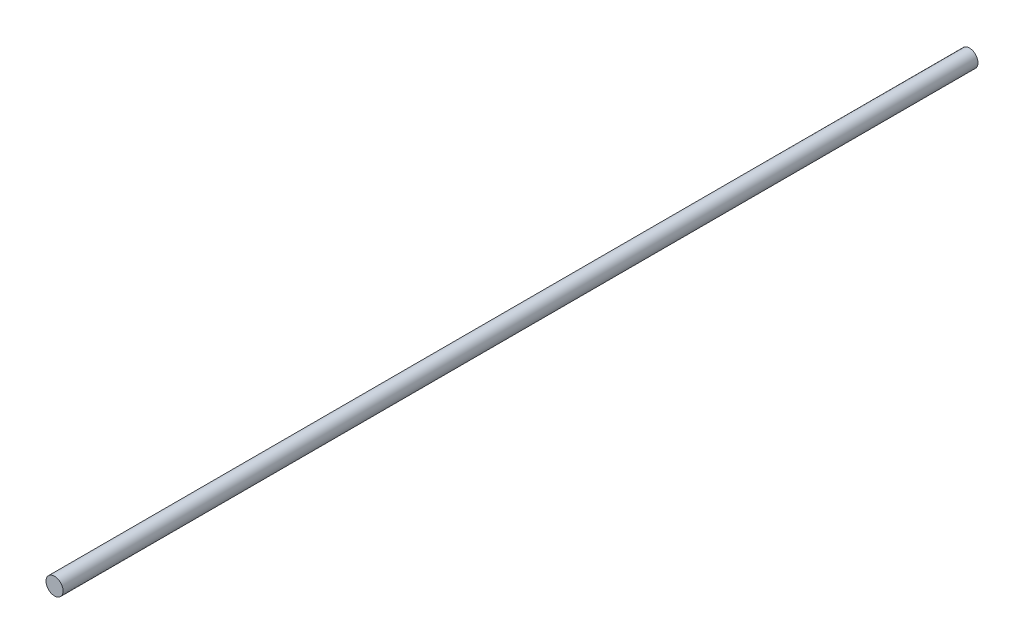
ISO-10303-21;
HEADER;
FILE_DESCRIPTION(('STEP AP214'),'2;1');
FILE_NAME('part.step','',(''),(''),'','','');
FILE_SCHEMA(('AUTOMOTIVE_DESIGN { 1 0 10303 214 1 1 1 1 }'));
ENDSEC;
DATA;
#1=APPLICATION_CONTEXT('core data for automotive mechanical design processes');
#2=APPLICATION_PROTOCOL_DEFINITION('international standard','automotive_design',2000,#1);
#3=PRODUCT_CONTEXT('',#1,'mechanical');
#4=PRODUCT('Part','Part','',(#3));
#5=PRODUCT_RELATED_PRODUCT_CATEGORY('part','',(#4));
#6=PRODUCT_DEFINITION_FORMATION('','',#4);
#7=PRODUCT_DEFINITION_CONTEXT('part definition',#1,'design');
#8=PRODUCT_DEFINITION('design','',#6,#7);
#9=PRODUCT_DEFINITION_SHAPE('','',#8);
#10=(LENGTH_UNIT() NAMED_UNIT(*) SI_UNIT(.MILLI.,.METRE.));
#11=(NAMED_UNIT(*) PLANE_ANGLE_UNIT() SI_UNIT($,.RADIAN.));
#12=(NAMED_UNIT(*) SI_UNIT($,.STERADIAN.) SOLID_ANGLE_UNIT());
#13=UNCERTAINTY_MEASURE_WITH_UNIT(LENGTH_MEASURE(1.E-05),#10,'distance_accuracy_value','');
#14=(GEOMETRIC_REPRESENTATION_CONTEXT(3) GLOBAL_UNCERTAINTY_ASSIGNED_CONTEXT((#13)) GLOBAL_UNIT_ASSIGNED_CONTEXT((#10,
#11,#12)) REPRESENTATION_CONTEXT('',''));
#15=CARTESIAN_POINT('',(0.,0.,0.));
#16=DIRECTION('',(0.,0.,1.));
#17=DIRECTION('',(1.,0.,0.));
#18=AXIS2_PLACEMENT_3D('',#15,#16,#17);
#19=CARTESIAN_POINT('',(0.,0.,428.));
#20=DIRECTION('',(0.,0.,-1.));
#21=DIRECTION('',(-1.,0.,0.));
#22=AXIS2_PLACEMENT_3D('',#19,#20,#21);
#23=CYLINDRICAL_SURFACE('',#22,4.);
#24=CARTESIAN_POINT('',(0.,0.,428.));
#25=DIRECTION('',(0.,0.,1.));
#26=DIRECTION('',(1.,0.,0.));
#27=AXIS2_PLACEMENT_3D('',#24,#25,#26);
#28=CIRCLE('',#27,4.);
#29=CARTESIAN_POINT('',(4.,0.,428.));
#30=VERTEX_POINT('',#29);
#31=EDGE_CURVE('E10',#30,#30,#28,.T.);
#32=ORIENTED_EDGE('',*,*,#31,.F.);
#33=EDGE_LOOP('',(#32));
#34=FACE_BOUND('',#33,.T.);
#35=CARTESIAN_POINT('',(0.,0.,0.));
#36=DIRECTION('',(0.,0.,1.));
#37=DIRECTION('',(1.,0.,0.));
#38=AXIS2_PLACEMENT_3D('',#35,#36,#37);
#39=CIRCLE('',#38,4.);
#40=CARTESIAN_POINT('',(4.,0.,0.));
#41=VERTEX_POINT('',#40);
#42=EDGE_CURVE('E35',#41,#41,#39,.T.);
#43=ORIENTED_EDGE('',*,*,#42,.T.);
#44=EDGE_LOOP('',(#43));
#45=FACE_BOUND('',#44,.T.);
#46=ADVANCED_FACE('F32',(#34,#45),#23,.T.);
#47=CARTESIAN_POINT('',(0.,0.,428.));
#48=DIRECTION('',(0.,0.,1.));
#49=DIRECTION('',(1.,0.,0.));
#50=AXIS2_PLACEMENT_3D('',#47,#48,#49);
#51=PLANE('',#50);
#52=ORIENTED_EDGE('',*,*,#31,.T.);
#53=EDGE_LOOP('',(#52));
#54=FACE_BOUND('',#53,.T.);
#55=ADVANCED_FACE('F47',(#54),#51,.T.);
#56=CARTESIAN_POINT('',(0.,0.,0.));
#57=DIRECTION('',(0.,0.,1.));
#58=DIRECTION('',(1.,0.,0.));
#59=AXIS2_PLACEMENT_3D('',#56,#57,#58);
#60=PLANE('',#59);
#61=ORIENTED_EDGE('',*,*,#42,.F.);
#62=EDGE_LOOP('',(#61));
#63=FACE_BOUND('',#62,.T.);
#64=ADVANCED_FACE('F45',(#63),#60,.F.);
#65=CLOSED_SHELL('',(#46,#55,#64));
#66=MANIFOLD_SOLID_BREP('B2',#65);
#67=ADVANCED_BREP_SHAPE_REPRESENTATION('',(#18,#66),#14);
#68=SHAPE_DEFINITION_REPRESENTATION(#9,#67);
ENDSEC;
END-ISO-10303-21;
